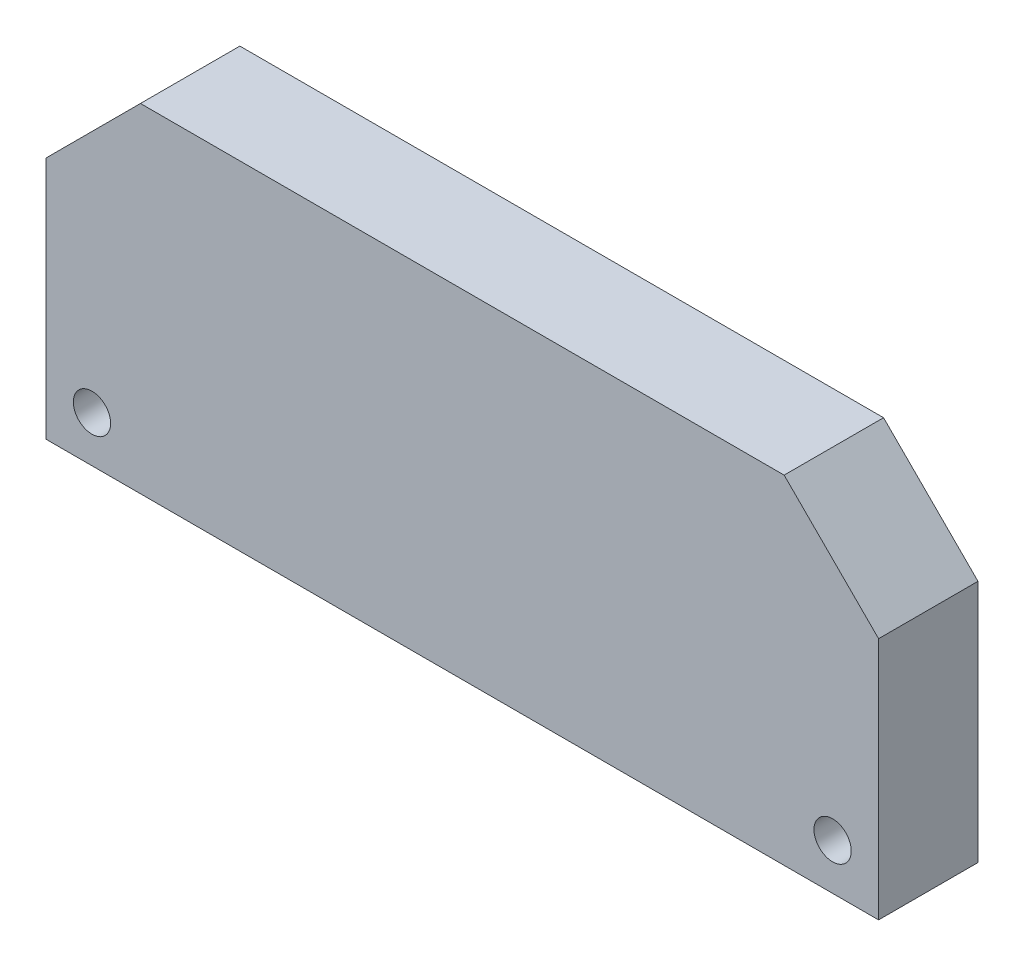
ISO-10303-21;
HEADER;
FILE_DESCRIPTION(('STEP AP214'),'2;1');
FILE_NAME('part.step','',(''),(''),'','','');
FILE_SCHEMA(('AUTOMOTIVE_DESIGN { 1 0 10303 214 1 1 1 1 }'));
ENDSEC;
DATA;
#1=APPLICATION_CONTEXT('core data for automotive mechanical design processes');
#2=APPLICATION_PROTOCOL_DEFINITION('international standard','automotive_design',2000,#1);
#3=PRODUCT_CONTEXT('',#1,'mechanical');
#4=PRODUCT('Part','Part','',(#3));
#5=PRODUCT_RELATED_PRODUCT_CATEGORY('part','',(#4));
#6=PRODUCT_DEFINITION_FORMATION('','',#4);
#7=PRODUCT_DEFINITION_CONTEXT('part definition',#1,'design');
#8=PRODUCT_DEFINITION('design','',#6,#7);
#9=PRODUCT_DEFINITION_SHAPE('','',#8);
#10=(LENGTH_UNIT() NAMED_UNIT(*) SI_UNIT(.MILLI.,.METRE.));
#11=(NAMED_UNIT(*) PLANE_ANGLE_UNIT() SI_UNIT($,.RADIAN.));
#12=(NAMED_UNIT(*) SI_UNIT($,.STERADIAN.) SOLID_ANGLE_UNIT());
#13=UNCERTAINTY_MEASURE_WITH_UNIT(LENGTH_MEASURE(1.E-05),#10,'distance_accuracy_value','');
#14=(GEOMETRIC_REPRESENTATION_CONTEXT(3) GLOBAL_UNCERTAINTY_ASSIGNED_CONTEXT((#13)) GLOBAL_UNIT_ASSIGNED_CONTEXT((#10,
#11,#12)) REPRESENTATION_CONTEXT('',''));
#15=CARTESIAN_POINT('',(0.,0.,0.));
#16=DIRECTION('',(0.,0.,1.));
#17=DIRECTION('',(1.,0.,0.));
#18=AXIS2_PLACEMENT_3D('',#15,#16,#17);
#19=CARTESIAN_POINT('',(33.5,13.6,8.));
#20=DIRECTION('',(-1.,0.,0.));
#21=DIRECTION('',(0.,0.,1.));
#22=AXIS2_PLACEMENT_3D('',#19,#20,#21);
#23=PLANE('',#22);
#24=DIRECTION('',(0.,1.,0.));
#25=VECTOR('',#24,1.);
#26=CARTESIAN_POINT('',(33.5,13.6,0.));
#27=LINE('',#26,#25);
#28=CARTESIAN_POINT('',(33.5,-13.6,0.));
#29=VERTEX_POINT('',#28);
#30=CARTESIAN_POINT('',(33.5,5.99999999999998,0.));
#31=VERTEX_POINT('',#30);
#32=EDGE_CURVE('E115',#29,#31,#27,.T.);
#33=ORIENTED_EDGE('',*,*,#32,.T.);
#34=DIRECTION('',(0.,0.,1.));
#35=VECTOR('',#34,1.);
#36=CARTESIAN_POINT('',(33.5,5.99999999999998,8.));
#37=LINE('',#36,#35);
#38=CARTESIAN_POINT('',(33.5,5.99999999999998,8.));
#39=VERTEX_POINT('',#38);
#40=EDGE_CURVE('E59',#31,#39,#37,.T.);
#41=ORIENTED_EDGE('',*,*,#40,.T.);
#42=DIRECTION('',(0.,1.,0.));
#43=VECTOR('',#42,1.);
#44=CARTESIAN_POINT('',(33.5,13.6,8.));
#45=LINE('',#44,#43);
#46=CARTESIAN_POINT('',(33.5,-13.6,8.));
#47=VERTEX_POINT('',#46);
#48=EDGE_CURVE('E123',#47,#39,#45,.T.);
#49=ORIENTED_EDGE('',*,*,#48,.F.);
#50=DIRECTION('',(0.,0.,-1.));
#51=VECTOR('',#50,1.);
#52=CARTESIAN_POINT('',(33.5,-13.6,8.));
#53=LINE('',#52,#51);
#54=EDGE_CURVE('E107',#47,#29,#53,.T.);
#55=ORIENTED_EDGE('',*,*,#54,.T.);
#56=EDGE_LOOP('',(#33,#41,#49,#55));
#57=FACE_BOUND('',#56,.T.);
#58=ADVANCED_FACE('F36',(#57),#23,.F.);
#59=CARTESIAN_POINT('',(-33.5,13.6,8.));
#60=DIRECTION('',(0.,-1.,0.));
#61=DIRECTION('',(0.,0.,-1.));
#62=AXIS2_PLACEMENT_3D('',#59,#60,#61);
#63=PLANE('',#62);
#64=DIRECTION('',(-1.,0.,0.));
#65=VECTOR('',#64,1.);
#66=CARTESIAN_POINT('',(-33.5,13.6,8.));
#67=LINE('',#66,#65);
#68=CARTESIAN_POINT('',(25.9,13.6,8.));
#69=VERTEX_POINT('',#68);
#70=CARTESIAN_POINT('',(-25.9,13.6,8.));
#71=VERTEX_POINT('',#70);
#72=EDGE_CURVE('E97',#69,#71,#67,.T.);
#73=ORIENTED_EDGE('',*,*,#72,.F.);
#74=DIRECTION('',(0.,0.,-1.));
#75=VECTOR('',#74,1.);
#76=CARTESIAN_POINT('',(25.9,13.6,8.));
#77=LINE('',#76,#75);
#78=CARTESIAN_POINT('',(25.9,13.6,0.));
#79=VERTEX_POINT('',#78);
#80=EDGE_CURVE('E126',#69,#79,#77,.T.);
#81=ORIENTED_EDGE('',*,*,#80,.T.);
#82=DIRECTION('',(-1.,0.,0.));
#83=VECTOR('',#82,1.);
#84=CARTESIAN_POINT('',(-33.5,13.6,0.));
#85=LINE('',#84,#83);
#86=CARTESIAN_POINT('',(-25.9,13.6,0.));
#87=VERTEX_POINT('',#86);
#88=EDGE_CURVE('E117',#79,#87,#85,.T.);
#89=ORIENTED_EDGE('',*,*,#88,.T.);
#90=DIRECTION('',(0.,0.,1.));
#91=VECTOR('',#90,1.);
#92=CARTESIAN_POINT('',(-25.9,13.6,8.));
#93=LINE('',#92,#91);
#94=EDGE_CURVE('E106',#87,#71,#93,.T.);
#95=ORIENTED_EDGE('',*,*,#94,.T.);
#96=EDGE_LOOP('',(#73,#81,#89,#95));
#97=FACE_BOUND('',#96,.T.);
#98=ADVANCED_FACE('F139',(#97),#63,.F.);
#99=CARTESIAN_POINT('',(-33.5,13.6,8.));
#100=DIRECTION('',(1.,0.,0.));
#101=DIRECTION('',(0.,0.,-1.));
#102=AXIS2_PLACEMENT_3D('',#99,#100,#101);
#103=PLANE('',#102);
#104=DIRECTION('',(0.,-1.,0.));
#105=VECTOR('',#104,1.);
#106=CARTESIAN_POINT('',(-33.5,13.6,8.));
#107=LINE('',#106,#105);
#108=CARTESIAN_POINT('',(-33.5,5.99999999999999,8.));
#109=VERTEX_POINT('',#108);
#110=CARTESIAN_POINT('',(-33.5,-13.6,8.));
#111=VERTEX_POINT('',#110);
#112=EDGE_CURVE('E89',#109,#111,#107,.T.);
#113=ORIENTED_EDGE('',*,*,#112,.F.);
#114=DIRECTION('',(0.,0.,-1.));
#115=VECTOR('',#114,1.);
#116=CARTESIAN_POINT('',(-33.5,5.99999999999999,8.));
#117=LINE('',#116,#115);
#118=CARTESIAN_POINT('',(-33.5,5.99999999999999,0.));
#119=VERTEX_POINT('',#118);
#120=EDGE_CURVE('E11',#109,#119,#117,.T.);
#121=ORIENTED_EDGE('',*,*,#120,.T.);
#122=DIRECTION('',(0.,-1.,0.));
#123=VECTOR('',#122,1.);
#124=CARTESIAN_POINT('',(-33.5,13.6,0.));
#125=LINE('',#124,#123);
#126=CARTESIAN_POINT('',(-33.5,-13.6,0.));
#127=VERTEX_POINT('',#126);
#128=EDGE_CURVE('E103',#119,#127,#125,.T.);
#129=ORIENTED_EDGE('',*,*,#128,.T.);
#130=DIRECTION('',(0.,0.,-1.));
#131=VECTOR('',#130,1.);
#132=CARTESIAN_POINT('',(-33.5,-13.6,8.));
#133=LINE('',#132,#131);
#134=EDGE_CURVE('E100',#111,#127,#133,.T.);
#135=ORIENTED_EDGE('',*,*,#134,.F.);
#136=EDGE_LOOP('',(#113,#121,#129,#135));
#137=FACE_BOUND('',#136,.T.);
#138=ADVANCED_FACE('F101',(#137),#103,.F.);
#139=CARTESIAN_POINT('',(-33.5,-13.6,8.));
#140=DIRECTION('',(0.,1.,0.));
#141=DIRECTION('',(0.,0.,1.));
#142=AXIS2_PLACEMENT_3D('',#139,#140,#141);
#143=PLANE('',#142);
#144=DIRECTION('',(1.,0.,0.));
#145=VECTOR('',#144,1.);
#146=CARTESIAN_POINT('',(-33.5,-13.6,0.));
#147=LINE('',#146,#145);
#148=EDGE_CURVE('E122',#127,#29,#147,.T.);
#149=ORIENTED_EDGE('',*,*,#148,.T.);
#150=ORIENTED_EDGE('',*,*,#54,.F.);
#151=DIRECTION('',(1.,0.,0.));
#152=VECTOR('',#151,1.);
#153=CARTESIAN_POINT('',(-33.5,-13.6,8.));
#154=LINE('',#153,#152);
#155=EDGE_CURVE('E93',#111,#47,#154,.T.);
#156=ORIENTED_EDGE('',*,*,#155,.F.);
#157=ORIENTED_EDGE('',*,*,#134,.T.);
#158=EDGE_LOOP('',(#149,#150,#156,#157));
#159=FACE_BOUND('',#158,.T.);
#160=ADVANCED_FACE('F109',(#159),#143,.F.);
#161=CARTESIAN_POINT('',(0.,0.,8.));
#162=DIRECTION('',(0.,0.,1.));
#163=DIRECTION('',(1.,0.,0.));
#164=AXIS2_PLACEMENT_3D('',#161,#162,#163);
#165=PLANE('',#164);
#166=CARTESIAN_POINT('',(29.8,-9.9,8.));
#167=DIRECTION('',(0.,0.,1.));
#168=DIRECTION('',(1.,0.,0.));
#169=AXIS2_PLACEMENT_3D('',#166,#167,#168);
#170=CIRCLE('',#169,1.5);
#171=CARTESIAN_POINT('',(31.3,-9.9,8.));
#172=VERTEX_POINT('',#171);
#173=EDGE_CURVE('E154',#172,#172,#170,.T.);
#174=ORIENTED_EDGE('',*,*,#173,.F.);
#175=EDGE_LOOP('',(#174));
#176=FACE_BOUND('',#175,.T.);
#177=CARTESIAN_POINT('',(-29.8,-9.9,8.));
#178=DIRECTION('',(0.,0.,1.));
#179=DIRECTION('',(1.,0.,0.));
#180=AXIS2_PLACEMENT_3D('',#177,#178,#179);
#181=CIRCLE('',#180,1.5);
#182=CARTESIAN_POINT('',(-28.3,-9.9,8.));
#183=VERTEX_POINT('',#182);
#184=EDGE_CURVE('E148',#183,#183,#181,.T.);
#185=ORIENTED_EDGE('',*,*,#184,.F.);
#186=EDGE_LOOP('',(#185));
#187=FACE_BOUND('',#186,.T.);
#188=ORIENTED_EDGE('',*,*,#48,.T.);
#189=DIRECTION('',(0.707106781186546,-0.707106781186549,0.));
#190=VECTOR('',#189,1.);
#191=CARTESIAN_POINT('',(19.75,19.75,8.));
#192=LINE('',#191,#190);
#193=EDGE_CURVE('E44',#39,#69,#192,.F.);
#194=ORIENTED_EDGE('',*,*,#193,.T.);
#195=ORIENTED_EDGE('',*,*,#72,.T.);
#196=DIRECTION('',(0.707106781186549,0.707106781186546,0.));
#197=VECTOR('',#196,1.);
#198=CARTESIAN_POINT('',(-19.7499999999999,19.75,8.));
#199=LINE('',#198,#197);
#200=EDGE_CURVE('E51',#71,#109,#199,.F.);
#201=ORIENTED_EDGE('',*,*,#200,.T.);
#202=ORIENTED_EDGE('',*,*,#112,.T.);
#203=ORIENTED_EDGE('',*,*,#155,.T.);
#204=EDGE_LOOP('',(#188,#194,#195,#201,#202,#203));
#205=FACE_BOUND('',#204,.T.);
#206=ADVANCED_FACE('F91',(#176,#187,#205),#165,.T.);
#207=CARTESIAN_POINT('',(0.,0.,0.));
#208=DIRECTION('',(0.,0.,1.));
#209=DIRECTION('',(1.,0.,0.));
#210=AXIS2_PLACEMENT_3D('',#207,#208,#209);
#211=PLANE('',#210);
#212=CARTESIAN_POINT('',(29.8,-9.9,0.));
#213=DIRECTION('',(0.,0.,1.));
#214=DIRECTION('',(1.,0.,0.));
#215=AXIS2_PLACEMENT_3D('',#212,#213,#214);
#216=CIRCLE('',#215,1.5);
#217=CARTESIAN_POINT('',(31.3,-9.9,0.));
#218=VERTEX_POINT('',#217);
#219=EDGE_CURVE('E118',#218,#218,#216,.T.);
#220=ORIENTED_EDGE('',*,*,#219,.T.);
#221=EDGE_LOOP('',(#220));
#222=FACE_BOUND('',#221,.T.);
#223=CARTESIAN_POINT('',(-29.8,-9.9,0.));
#224=DIRECTION('',(0.,0.,1.));
#225=DIRECTION('',(1.,0.,0.));
#226=AXIS2_PLACEMENT_3D('',#223,#224,#225);
#227=CIRCLE('',#226,1.5);
#228=CARTESIAN_POINT('',(-28.3,-9.9,0.));
#229=VERTEX_POINT('',#228);
#230=EDGE_CURVE('E151',#229,#229,#227,.T.);
#231=ORIENTED_EDGE('',*,*,#230,.T.);
#232=EDGE_LOOP('',(#231));
#233=FACE_BOUND('',#232,.T.);
#234=ORIENTED_EDGE('',*,*,#88,.F.);
#235=DIRECTION('',(-0.707106781186546,0.707106781186549,0.));
#236=VECTOR('',#235,1.);
#237=CARTESIAN_POINT('',(25.9,13.6,0.));
#238=LINE('',#237,#236);
#239=EDGE_CURVE('E131',#79,#31,#238,.F.);
#240=ORIENTED_EDGE('',*,*,#239,.T.);
#241=ORIENTED_EDGE('',*,*,#32,.F.);
#242=ORIENTED_EDGE('',*,*,#148,.F.);
#243=ORIENTED_EDGE('',*,*,#128,.F.);
#244=DIRECTION('',(-0.707106781186549,-0.707106781186546,0.));
#245=VECTOR('',#244,1.);
#246=CARTESIAN_POINT('',(-33.5,5.99999999999999,0.));
#247=LINE('',#246,#245);
#248=EDGE_CURVE('E129',#119,#87,#247,.F.);
#249=ORIENTED_EDGE('',*,*,#248,.T.);
#250=EDGE_LOOP('',(#234,#240,#241,#242,#243,#249));
#251=FACE_BOUND('',#250,.T.);
#252=ADVANCED_FACE('F145',(#222,#233,#251),#211,.F.);
#253=CARTESIAN_POINT('',(-29.8,-9.9,0.));
#254=DIRECTION('',(0.,0.,1.));
#255=DIRECTION('',(1.,0.,0.));
#256=AXIS2_PLACEMENT_3D('',#253,#254,#255);
#257=CYLINDRICAL_SURFACE('',#256,1.5);
#258=ORIENTED_EDGE('',*,*,#230,.F.);
#259=EDGE_LOOP('',(#258));
#260=FACE_BOUND('',#259,.T.);
#261=ORIENTED_EDGE('',*,*,#184,.T.);
#262=EDGE_LOOP('',(#261));
#263=FACE_BOUND('',#262,.T.);
#264=ADVANCED_FACE('F165',(#260,#263),#257,.F.);
#265=CARTESIAN_POINT('',(29.8,-9.9,0.));
#266=DIRECTION('',(0.,0.,1.));
#267=DIRECTION('',(1.,0.,0.));
#268=AXIS2_PLACEMENT_3D('',#265,#266,#267);
#269=CYLINDRICAL_SURFACE('',#268,1.5);
#270=ORIENTED_EDGE('',*,*,#219,.F.);
#271=EDGE_LOOP('',(#270));
#272=FACE_BOUND('',#271,.T.);
#273=ORIENTED_EDGE('',*,*,#173,.T.);
#274=EDGE_LOOP('',(#273));
#275=FACE_BOUND('',#274,.T.);
#276=ADVANCED_FACE('F162',(#272,#275),#269,.F.);
#277=CARTESIAN_POINT('',(25.9,13.6,8.));
#278=DIRECTION('',(-0.707106781186549,-0.707106781186546,0.));
#279=DIRECTION('',(0.,0.,-1.));
#280=AXIS2_PLACEMENT_3D('',#277,#278,#279);
#281=PLANE('',#280);
#282=ORIENTED_EDGE('',*,*,#193,.F.);
#283=ORIENTED_EDGE('',*,*,#40,.F.);
#284=ORIENTED_EDGE('',*,*,#239,.F.);
#285=ORIENTED_EDGE('',*,*,#80,.F.);
#286=EDGE_LOOP('',(#282,#283,#284,#285));
#287=FACE_BOUND('',#286,.T.);
#288=ADVANCED_FACE('F142',(#287),#281,.F.);
#289=CARTESIAN_POINT('',(-33.5,5.99999999999999,8.));
#290=DIRECTION('',(0.707106781186546,-0.707106781186549,0.));
#291=DIRECTION('',(0.,0.,-1.));
#292=AXIS2_PLACEMENT_3D('',#289,#290,#291);
#293=PLANE('',#292);
#294=ORIENTED_EDGE('',*,*,#200,.F.);
#295=ORIENTED_EDGE('',*,*,#94,.F.);
#296=ORIENTED_EDGE('',*,*,#248,.F.);
#297=ORIENTED_EDGE('',*,*,#120,.F.);
#298=EDGE_LOOP('',(#294,#295,#296,#297));
#299=FACE_BOUND('',#298,.T.);
#300=ADVANCED_FACE('F38',(#299),#293,.F.);
#301=CLOSED_SHELL('',(#58,#98,#138,#160,#206,#252,#264,#276,#288,#300));
#302=MANIFOLD_SOLID_BREP('B2',#301);
#303=ADVANCED_BREP_SHAPE_REPRESENTATION('',(#18,#302),#14);
#304=SHAPE_DEFINITION_REPRESENTATION(#9,#303);
ENDSEC;
END-ISO-10303-21;
